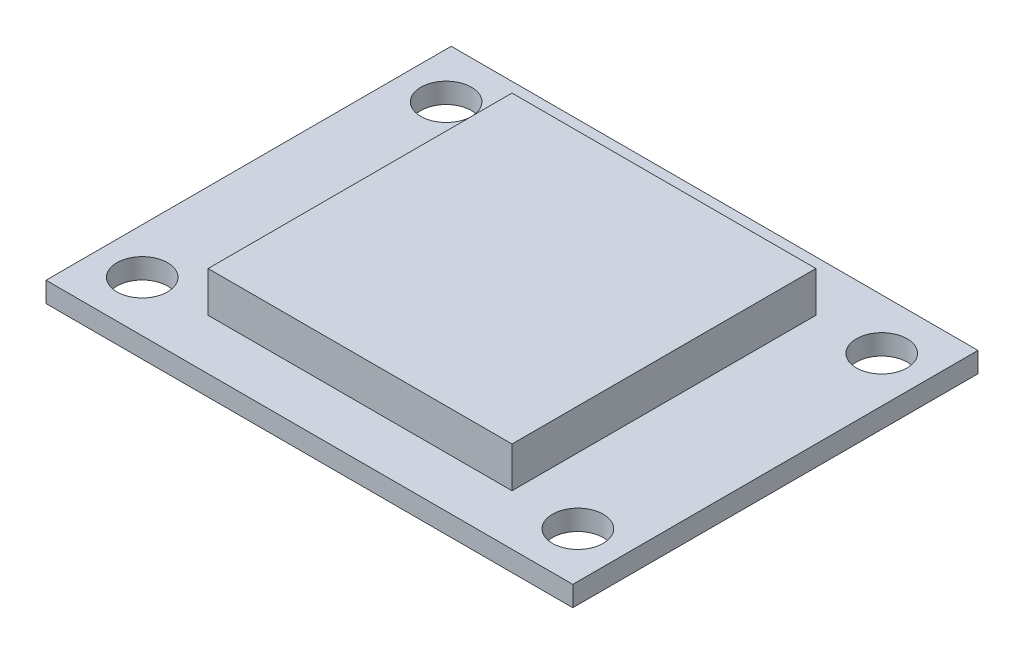
ISO-10303-21;
HEADER;
FILE_DESCRIPTION(('STEP AP214'),'2;1');
FILE_NAME('part.step','',(''),(''),'','','');
FILE_SCHEMA(('AUTOMOTIVE_DESIGN { 1 0 10303 214 1 1 1 1 }'));
ENDSEC;
DATA;
#1=APPLICATION_CONTEXT('core data for automotive mechanical design processes');
#2=APPLICATION_PROTOCOL_DEFINITION('international standard','automotive_design',2000,#1);
#3=PRODUCT_CONTEXT('',#1,'mechanical');
#4=PRODUCT('Part','Part','',(#3));
#5=PRODUCT_RELATED_PRODUCT_CATEGORY('part','',(#4));
#6=PRODUCT_DEFINITION_FORMATION('','',#4);
#7=PRODUCT_DEFINITION_CONTEXT('part definition',#1,'design');
#8=PRODUCT_DEFINITION('design','',#6,#7);
#9=PRODUCT_DEFINITION_SHAPE('','',#8);
#10=(LENGTH_UNIT() NAMED_UNIT(*) SI_UNIT(.MILLI.,.METRE.));
#11=(NAMED_UNIT(*) PLANE_ANGLE_UNIT() SI_UNIT($,.RADIAN.));
#12=(NAMED_UNIT(*) SI_UNIT($,.STERADIAN.) SOLID_ANGLE_UNIT());
#13=UNCERTAINTY_MEASURE_WITH_UNIT(LENGTH_MEASURE(1.E-05),#10,'distance_accuracy_value','');
#14=(GEOMETRIC_REPRESENTATION_CONTEXT(3) GLOBAL_UNCERTAINTY_ASSIGNED_CONTEXT((#13)) GLOBAL_UNIT_ASSIGNED_CONTEXT((#10,
#11,#12)) REPRESENTATION_CONTEXT('',''));
#15=CARTESIAN_POINT('',(0.,0.,0.));
#16=DIRECTION('',(0.,0.,1.));
#17=DIRECTION('',(1.,0.,0.));
#18=AXIS2_PLACEMENT_3D('',#15,#16,#17);
#19=CARTESIAN_POINT('',(0.,1.,0.));
#20=DIRECTION('',(0.,1.,0.));
#21=DIRECTION('',(0.,0.,1.));
#22=AXIS2_PLACEMENT_3D('',#19,#20,#21);
#23=PLANE('',#22);
#24=CARTESIAN_POINT('',(10.75,1.,-7.5));
#25=DIRECTION('',(0.,1.,0.));
#26=DIRECTION('',(0.,0.,-1.));
#27=AXIS2_PLACEMENT_3D('',#24,#25,#26);
#28=CIRCLE('',#27,1.25);
#29=CARTESIAN_POINT('',(10.75,1.,-8.75));
#30=VERTEX_POINT('',#29);
#31=EDGE_CURVE('E163',#30,#30,#28,.T.);
#32=ORIENTED_EDGE('',*,*,#31,.F.);
#33=EDGE_LOOP('',(#32));
#34=FACE_BOUND('',#33,.T.);
#35=CARTESIAN_POINT('',(10.75,1.,7.5));
#36=DIRECTION('',(0.,1.,0.));
#37=DIRECTION('',(0.,0.,1.));
#38=AXIS2_PLACEMENT_3D('',#35,#36,#37);
#39=CIRCLE('',#38,1.25);
#40=CARTESIAN_POINT('',(10.75,1.,8.75));
#41=VERTEX_POINT('',#40);
#42=EDGE_CURVE('E177',#41,#41,#39,.T.);
#43=ORIENTED_EDGE('',*,*,#42,.F.);
#44=EDGE_LOOP('',(#43));
#45=FACE_BOUND('',#44,.T.);
#46=CARTESIAN_POINT('',(-10.75,1.,7.5));
#47=DIRECTION('',(0.,1.,0.));
#48=DIRECTION('',(0.,0.,-1.));
#49=AXIS2_PLACEMENT_3D('',#46,#47,#48);
#50=CIRCLE('',#49,1.25);
#51=CARTESIAN_POINT('',(-10.75,1.,6.25));
#52=VERTEX_POINT('',#51);
#53=EDGE_CURVE('E169',#52,#52,#50,.T.);
#54=ORIENTED_EDGE('',*,*,#53,.F.);
#55=EDGE_LOOP('',(#54));
#56=FACE_BOUND('',#55,.T.);
#57=CARTESIAN_POINT('',(-10.75,1.,-7.5));
#58=DIRECTION('',(0.,1.,0.));
#59=DIRECTION('',(0.,0.,1.));
#60=AXIS2_PLACEMENT_3D('',#57,#58,#59);
#61=CIRCLE('',#60,1.25);
#62=CARTESIAN_POINT('',(-10.75,1.,-6.25));
#63=VERTEX_POINT('',#62);
#64=EDGE_CURVE('E188',#63,#63,#61,.T.);
#65=ORIENTED_EDGE('',*,*,#64,.F.);
#66=EDGE_LOOP('',(#65));
#67=FACE_BOUND('',#66,.T.);
#68=DIRECTION('',(0.,0.,-1.));
#69=VECTOR('',#68,1.);
#70=CARTESIAN_POINT('',(13.,1.,-10.));
#71=LINE('',#70,#69);
#72=CARTESIAN_POINT('',(13.,1.,10.));
#73=VERTEX_POINT('',#72);
#74=CARTESIAN_POINT('',(13.,1.,-10.));
#75=VERTEX_POINT('',#74);
#76=EDGE_CURVE('E196',#73,#75,#71,.T.);
#77=ORIENTED_EDGE('',*,*,#76,.T.);
#78=DIRECTION('',(-1.,0.,0.));
#79=VECTOR('',#78,1.);
#80=CARTESIAN_POINT('',(-13.,1.,-10.));
#81=LINE('',#80,#79);
#82=CARTESIAN_POINT('',(-13.,1.,-10.));
#83=VERTEX_POINT('',#82);
#84=EDGE_CURVE('E96',#75,#83,#81,.T.);
#85=ORIENTED_EDGE('',*,*,#84,.T.);
#86=DIRECTION('',(0.,0.,1.));
#87=VECTOR('',#86,1.);
#88=CARTESIAN_POINT('',(-13.,1.,-10.));
#89=LINE('',#88,#87);
#90=CARTESIAN_POINT('',(-13.,1.,10.));
#91=VERTEX_POINT('',#90);
#92=EDGE_CURVE('E201',#83,#91,#89,.T.);
#93=ORIENTED_EDGE('',*,*,#92,.T.);
#94=DIRECTION('',(1.,0.,0.));
#95=VECTOR('',#94,1.);
#96=CARTESIAN_POINT('',(-13.,1.,10.));
#97=LINE('',#96,#95);
#98=EDGE_CURVE('E68',#91,#73,#97,.T.);
#99=ORIENTED_EDGE('',*,*,#98,.T.);
#100=EDGE_LOOP('',(#77,#85,#93,#99));
#101=FACE_BOUND('',#100,.T.);
#102=DIRECTION('',(1.,0.,0.));
#103=VECTOR('',#102,1.);
#104=CARTESIAN_POINT('',(0.,1.,-7.5));
#105=LINE('',#104,#103);
#106=CARTESIAN_POINT('',(-7.5,1.,-7.5));
#107=VERTEX_POINT('',#106);
#108=CARTESIAN_POINT('',(7.5,1.,-7.5));
#109=VERTEX_POINT('',#108);
#110=EDGE_CURVE('E158',#107,#109,#105,.T.);
#111=ORIENTED_EDGE('',*,*,#110,.T.);
#112=DIRECTION('',(0.,0.,1.));
#113=VECTOR('',#112,1.);
#114=CARTESIAN_POINT('',(7.5,1.,0.));
#115=LINE('',#114,#113);
#116=CARTESIAN_POINT('',(7.5,1.,7.5));
#117=VERTEX_POINT('',#116);
#118=EDGE_CURVE('E143',#109,#117,#115,.T.);
#119=ORIENTED_EDGE('',*,*,#118,.T.);
#120=DIRECTION('',(-1.,0.,0.));
#121=VECTOR('',#120,1.);
#122=CARTESIAN_POINT('',(0.,1.,7.5));
#123=LINE('',#122,#121);
#124=CARTESIAN_POINT('',(-7.5,1.,7.5));
#125=VERTEX_POINT('',#124);
#126=EDGE_CURVE('E145',#117,#125,#123,.T.);
#127=ORIENTED_EDGE('',*,*,#126,.T.);
#128=DIRECTION('',(0.,0.,-1.));
#129=VECTOR('',#128,1.);
#130=CARTESIAN_POINT('',(-7.5,1.,0.));
#131=LINE('',#130,#129);
#132=EDGE_CURVE('E150',#125,#107,#131,.T.);
#133=ORIENTED_EDGE('',*,*,#132,.T.);
#134=EDGE_LOOP('',(#111,#119,#127,#133));
#135=FACE_BOUND('',#134,.T.);
#136=ADVANCED_FACE('F43',(#34,#45,#56,#67,#101,#135),#23,.T.);
#137=CARTESIAN_POINT('',(13.,1.,-10.));
#138=DIRECTION('',(-1.,0.,0.));
#139=DIRECTION('',(0.,0.,1.));
#140=AXIS2_PLACEMENT_3D('',#137,#138,#139);
#141=PLANE('',#140);
#142=DIRECTION('',(0.,0.,-1.));
#143=VECTOR('',#142,1.);
#144=CARTESIAN_POINT('',(13.,0.,-10.));
#145=LINE('',#144,#143);
#146=CARTESIAN_POINT('',(13.,0.,10.));
#147=VERTEX_POINT('',#146);
#148=CARTESIAN_POINT('',(13.,0.,-10.));
#149=VERTEX_POINT('',#148);
#150=EDGE_CURVE('E192',#147,#149,#145,.T.);
#151=ORIENTED_EDGE('',*,*,#150,.T.);
#152=DIRECTION('',(0.,-1.,0.));
#153=VECTOR('',#152,1.);
#154=CARTESIAN_POINT('',(13.,1.,-10.));
#155=LINE('',#154,#153);
#156=EDGE_CURVE('E11',#75,#149,#155,.T.);
#157=ORIENTED_EDGE('',*,*,#156,.F.);
#158=ORIENTED_EDGE('',*,*,#76,.F.);
#159=DIRECTION('',(0.,-1.,0.));
#160=VECTOR('',#159,1.);
#161=CARTESIAN_POINT('',(13.,1.,10.));
#162=LINE('',#161,#160);
#163=EDGE_CURVE('E206',#73,#147,#162,.T.);
#164=ORIENTED_EDGE('',*,*,#163,.T.);
#165=EDGE_LOOP('',(#151,#157,#158,#164));
#166=FACE_BOUND('',#165,.T.);
#167=ADVANCED_FACE('F45',(#166),#141,.F.);
#168=CARTESIAN_POINT('',(-13.,1.,-10.));
#169=DIRECTION('',(0.,0.,1.));
#170=DIRECTION('',(1.,0.,0.));
#171=AXIS2_PLACEMENT_3D('',#168,#169,#170);
#172=PLANE('',#171);
#173=DIRECTION('',(-1.,0.,0.));
#174=VECTOR('',#173,1.);
#175=CARTESIAN_POINT('',(-13.,0.,-10.));
#176=LINE('',#175,#174);
#177=CARTESIAN_POINT('',(-13.,0.,-10.));
#178=VERTEX_POINT('',#177);
#179=EDGE_CURVE('E210',#149,#178,#176,.T.);
#180=ORIENTED_EDGE('',*,*,#179,.T.);
#181=DIRECTION('',(0.,-1.,0.));
#182=VECTOR('',#181,1.);
#183=CARTESIAN_POINT('',(-13.,1.,-10.));
#184=LINE('',#183,#182);
#185=EDGE_CURVE('E52',#83,#178,#184,.T.);
#186=ORIENTED_EDGE('',*,*,#185,.F.);
#187=ORIENTED_EDGE('',*,*,#84,.F.);
#188=ORIENTED_EDGE('',*,*,#156,.T.);
#189=EDGE_LOOP('',(#180,#186,#187,#188));
#190=FACE_BOUND('',#189,.T.);
#191=ADVANCED_FACE('F245',(#190),#172,.F.);
#192=CARTESIAN_POINT('',(-13.,1.,-10.));
#193=DIRECTION('',(1.,0.,0.));
#194=DIRECTION('',(0.,0.,-1.));
#195=AXIS2_PLACEMENT_3D('',#192,#193,#194);
#196=PLANE('',#195);
#197=DIRECTION('',(0.,0.,1.));
#198=VECTOR('',#197,1.);
#199=CARTESIAN_POINT('',(-13.,0.,-10.));
#200=LINE('',#199,#198);
#201=CARTESIAN_POINT('',(-13.,0.,10.));
#202=VERTEX_POINT('',#201);
#203=EDGE_CURVE('E213',#178,#202,#200,.T.);
#204=ORIENTED_EDGE('',*,*,#203,.T.);
#205=DIRECTION('',(0.,-1.,0.));
#206=VECTOR('',#205,1.);
#207=CARTESIAN_POINT('',(-13.,1.,10.));
#208=LINE('',#207,#206);
#209=EDGE_CURVE('E220',#91,#202,#208,.T.);
#210=ORIENTED_EDGE('',*,*,#209,.F.);
#211=ORIENTED_EDGE('',*,*,#92,.F.);
#212=ORIENTED_EDGE('',*,*,#185,.T.);
#213=EDGE_LOOP('',(#204,#210,#211,#212));
#214=FACE_BOUND('',#213,.T.);
#215=ADVANCED_FACE('F227',(#214),#196,.F.);
#216=CARTESIAN_POINT('',(-13.,1.,10.));
#217=DIRECTION('',(0.,0.,-1.));
#218=DIRECTION('',(-1.,0.,0.));
#219=AXIS2_PLACEMENT_3D('',#216,#217,#218);
#220=PLANE('',#219);
#221=DIRECTION('',(1.,0.,0.));
#222=VECTOR('',#221,1.);
#223=CARTESIAN_POINT('',(-13.,0.,10.));
#224=LINE('',#223,#222);
#225=EDGE_CURVE('E89',#202,#147,#224,.T.);
#226=ORIENTED_EDGE('',*,*,#225,.T.);
#227=ORIENTED_EDGE('',*,*,#163,.F.);
#228=ORIENTED_EDGE('',*,*,#98,.F.);
#229=ORIENTED_EDGE('',*,*,#209,.T.);
#230=EDGE_LOOP('',(#226,#227,#228,#229));
#231=FACE_BOUND('',#230,.T.);
#232=ADVANCED_FACE('F236',(#231),#220,.F.);
#233=CARTESIAN_POINT('',(0.,0.,0.));
#234=DIRECTION('',(0.,1.,0.));
#235=DIRECTION('',(0.,0.,1.));
#236=AXIS2_PLACEMENT_3D('',#233,#234,#235);
#237=PLANE('',#236);
#238=ORIENTED_EDGE('',*,*,#150,.F.);
#239=ORIENTED_EDGE('',*,*,#225,.F.);
#240=ORIENTED_EDGE('',*,*,#203,.F.);
#241=ORIENTED_EDGE('',*,*,#179,.F.);
#242=EDGE_LOOP('',(#238,#239,#240,#241));
#243=FACE_BOUND('',#242,.T.);
#244=CARTESIAN_POINT('',(-10.75,0.,-7.5));
#245=DIRECTION('',(0.,1.,0.));
#246=DIRECTION('',(0.,0.,1.));
#247=AXIS2_PLACEMENT_3D('',#244,#245,#246);
#248=CIRCLE('',#247,1.25);
#249=CARTESIAN_POINT('',(-10.75,0.,-6.25));
#250=VERTEX_POINT('',#249);
#251=EDGE_CURVE('E168',#250,#250,#248,.T.);
#252=ORIENTED_EDGE('',*,*,#251,.T.);
#253=EDGE_LOOP('',(#252));
#254=FACE_BOUND('',#253,.T.);
#255=CARTESIAN_POINT('',(-10.75,0.,7.5));
#256=DIRECTION('',(0.,1.,0.));
#257=DIRECTION('',(0.,0.,-1.));
#258=AXIS2_PLACEMENT_3D('',#255,#256,#257);
#259=CIRCLE('',#258,1.25);
#260=CARTESIAN_POINT('',(-10.75,0.,6.25));
#261=VERTEX_POINT('',#260);
#262=EDGE_CURVE('E164',#261,#261,#259,.T.);
#263=ORIENTED_EDGE('',*,*,#262,.T.);
#264=EDGE_LOOP('',(#263));
#265=FACE_BOUND('',#264,.T.);
#266=CARTESIAN_POINT('',(10.75,0.,7.5));
#267=DIRECTION('',(0.,1.,0.));
#268=DIRECTION('',(0.,0.,1.));
#269=AXIS2_PLACEMENT_3D('',#266,#267,#268);
#270=CIRCLE('',#269,1.25);
#271=CARTESIAN_POINT('',(10.75,0.,8.75));
#272=VERTEX_POINT('',#271);
#273=EDGE_CURVE('E173',#272,#272,#270,.T.);
#274=ORIENTED_EDGE('',*,*,#273,.T.);
#275=EDGE_LOOP('',(#274));
#276=FACE_BOUND('',#275,.T.);
#277=CARTESIAN_POINT('',(10.75,0.,-7.5));
#278=DIRECTION('',(0.,1.,0.));
#279=DIRECTION('',(0.,0.,-1.));
#280=AXIS2_PLACEMENT_3D('',#277,#278,#279);
#281=CIRCLE('',#280,1.25);
#282=CARTESIAN_POINT('',(10.75,0.,-8.75));
#283=VERTEX_POINT('',#282);
#284=EDGE_CURVE('E181',#283,#283,#281,.T.);
#285=ORIENTED_EDGE('',*,*,#284,.T.);
#286=EDGE_LOOP('',(#285));
#287=FACE_BOUND('',#286,.T.);
#288=ADVANCED_FACE('F231',(#243,#254,#265,#276,#287),#237,.F.);
#289=CARTESIAN_POINT('',(-10.75,1.,-7.5));
#290=DIRECTION('',(0.,-1.,0.));
#291=DIRECTION('',(0.,0.,-1.));
#292=AXIS2_PLACEMENT_3D('',#289,#290,#291);
#293=CYLINDRICAL_SURFACE('',#292,1.25);
#294=ORIENTED_EDGE('',*,*,#64,.T.);
#295=EDGE_LOOP('',(#294));
#296=FACE_BOUND('',#295,.T.);
#297=ORIENTED_EDGE('',*,*,#251,.F.);
#298=EDGE_LOOP('',(#297));
#299=FACE_BOUND('',#298,.T.);
#300=ADVANCED_FACE('F243',(#296,#299),#293,.F.);
#301=CARTESIAN_POINT('',(-10.75,1.,7.5));
#302=DIRECTION('',(0.,-1.,0.));
#303=DIRECTION('',(0.,0.,-1.));
#304=AXIS2_PLACEMENT_3D('',#301,#302,#303);
#305=CYLINDRICAL_SURFACE('',#304,1.25);
#306=ORIENTED_EDGE('',*,*,#53,.T.);
#307=EDGE_LOOP('',(#306));
#308=FACE_BOUND('',#307,.T.);
#309=ORIENTED_EDGE('',*,*,#262,.F.);
#310=EDGE_LOOP('',(#309));
#311=FACE_BOUND('',#310,.T.);
#312=ADVANCED_FACE('F258',(#308,#311),#305,.F.);
#313=CARTESIAN_POINT('',(10.75,1.,7.5));
#314=DIRECTION('',(0.,-1.,0.));
#315=DIRECTION('',(0.,0.,-1.));
#316=AXIS2_PLACEMENT_3D('',#313,#314,#315);
#317=CYLINDRICAL_SURFACE('',#316,1.25);
#318=ORIENTED_EDGE('',*,*,#42,.T.);
#319=EDGE_LOOP('',(#318));
#320=FACE_BOUND('',#319,.T.);
#321=ORIENTED_EDGE('',*,*,#273,.F.);
#322=EDGE_LOOP('',(#321));
#323=FACE_BOUND('',#322,.T.);
#324=ADVANCED_FACE('F263',(#320,#323),#317,.F.);
#325=CARTESIAN_POINT('',(10.75,1.,-7.5));
#326=DIRECTION('',(0.,-1.,0.));
#327=DIRECTION('',(0.,0.,-1.));
#328=AXIS2_PLACEMENT_3D('',#325,#326,#327);
#329=CYLINDRICAL_SURFACE('',#328,1.25);
#330=ORIENTED_EDGE('',*,*,#31,.T.);
#331=EDGE_LOOP('',(#330));
#332=FACE_BOUND('',#331,.T.);
#333=ORIENTED_EDGE('',*,*,#284,.F.);
#334=EDGE_LOOP('',(#333));
#335=FACE_BOUND('',#334,.T.);
#336=ADVANCED_FACE('F260',(#332,#335),#329,.F.);
#337=CARTESIAN_POINT('',(7.5,3.,-7.5));
#338=DIRECTION('',(-1.,0.,0.));
#339=DIRECTION('',(0.,0.,1.));
#340=AXIS2_PLACEMENT_3D('',#337,#338,#339);
#341=PLANE('',#340);
#342=ORIENTED_EDGE('',*,*,#118,.F.);
#343=DIRECTION('',(0.,-1.,0.));
#344=VECTOR('',#343,1.);
#345=CARTESIAN_POINT('',(7.5,3.,-7.5));
#346=LINE('',#345,#344);
#347=CARTESIAN_POINT('',(7.5,3.,-7.5));
#348=VERTEX_POINT('',#347);
#349=EDGE_CURVE('E123',#348,#109,#346,.T.);
#350=ORIENTED_EDGE('',*,*,#349,.F.);
#351=DIRECTION('',(0.,0.,-1.));
#352=VECTOR('',#351,1.);
#353=CARTESIAN_POINT('',(7.5,3.,-7.5));
#354=LINE('',#353,#352);
#355=CARTESIAN_POINT('',(7.5,3.,7.5));
#356=VERTEX_POINT('',#355);
#357=EDGE_CURVE('E131',#356,#348,#354,.T.);
#358=ORIENTED_EDGE('',*,*,#357,.F.);
#359=DIRECTION('',(0.,-1.,0.));
#360=VECTOR('',#359,1.);
#361=CARTESIAN_POINT('',(7.5,3.,7.5));
#362=LINE('',#361,#360);
#363=EDGE_CURVE('E400',#356,#117,#362,.T.);
#364=ORIENTED_EDGE('',*,*,#363,.T.);
#365=EDGE_LOOP('',(#342,#350,#358,#364));
#366=FACE_BOUND('',#365,.T.);
#367=ADVANCED_FACE('F141',(#366),#341,.F.);
#368=CARTESIAN_POINT('',(-7.5,3.,-7.5));
#369=DIRECTION('',(0.,0.,1.));
#370=DIRECTION('',(1.,0.,0.));
#371=AXIS2_PLACEMENT_3D('',#368,#369,#370);
#372=PLANE('',#371);
#373=ORIENTED_EDGE('',*,*,#110,.F.);
#374=DIRECTION('',(0.,-1.,0.));
#375=VECTOR('',#374,1.);
#376=CARTESIAN_POINT('',(-7.5,3.,-7.5));
#377=LINE('',#376,#375);
#378=CARTESIAN_POINT('',(-7.5,3.,-7.5));
#379=VERTEX_POINT('',#378);
#380=EDGE_CURVE('E126',#379,#107,#377,.T.);
#381=ORIENTED_EDGE('',*,*,#380,.F.);
#382=DIRECTION('',(-1.,0.,0.));
#383=VECTOR('',#382,1.);
#384=CARTESIAN_POINT('',(-7.5,3.,-7.5));
#385=LINE('',#384,#383);
#386=EDGE_CURVE('E119',#348,#379,#385,.T.);
#387=ORIENTED_EDGE('',*,*,#386,.F.);
#388=ORIENTED_EDGE('',*,*,#349,.T.);
#389=EDGE_LOOP('',(#373,#381,#387,#388));
#390=FACE_BOUND('',#389,.T.);
#391=ADVANCED_FACE('F121',(#390),#372,.F.);
#392=CARTESIAN_POINT('',(-7.5,3.,-7.5));
#393=DIRECTION('',(1.,0.,0.));
#394=DIRECTION('',(0.,0.,-1.));
#395=AXIS2_PLACEMENT_3D('',#392,#393,#394);
#396=PLANE('',#395);
#397=ORIENTED_EDGE('',*,*,#132,.F.);
#398=DIRECTION('',(0.,-1.,0.));
#399=VECTOR('',#398,1.);
#400=CARTESIAN_POINT('',(-7.5,3.,7.5));
#401=LINE('',#400,#399);
#402=CARTESIAN_POINT('',(-7.5,3.,7.5));
#403=VERTEX_POINT('',#402);
#404=EDGE_CURVE('E59',#403,#125,#401,.T.);
#405=ORIENTED_EDGE('',*,*,#404,.F.);
#406=DIRECTION('',(0.,0.,1.));
#407=VECTOR('',#406,1.);
#408=CARTESIAN_POINT('',(-7.5,3.,-7.5));
#409=LINE('',#408,#407);
#410=EDGE_CURVE('E130',#379,#403,#409,.T.);
#411=ORIENTED_EDGE('',*,*,#410,.F.);
#412=ORIENTED_EDGE('',*,*,#380,.T.);
#413=EDGE_LOOP('',(#397,#405,#411,#412));
#414=FACE_BOUND('',#413,.T.);
#415=ADVANCED_FACE('F275',(#414),#396,.F.);
#416=CARTESIAN_POINT('',(-7.5,3.,7.5));
#417=DIRECTION('',(0.,0.,-1.));
#418=DIRECTION('',(-1.,0.,0.));
#419=AXIS2_PLACEMENT_3D('',#416,#417,#418);
#420=PLANE('',#419);
#421=ORIENTED_EDGE('',*,*,#126,.F.);
#422=ORIENTED_EDGE('',*,*,#363,.F.);
#423=DIRECTION('',(1.,0.,0.));
#424=VECTOR('',#423,1.);
#425=CARTESIAN_POINT('',(-7.5,3.,7.5));
#426=LINE('',#425,#424);
#427=EDGE_CURVE('E135',#403,#356,#426,.T.);
#428=ORIENTED_EDGE('',*,*,#427,.F.);
#429=ORIENTED_EDGE('',*,*,#404,.T.);
#430=EDGE_LOOP('',(#421,#422,#428,#429));
#431=FACE_BOUND('',#430,.T.);
#432=ADVANCED_FACE('F278',(#431),#420,.F.);
#433=CARTESIAN_POINT('',(0.,3.,0.));
#434=DIRECTION('',(0.,1.,0.));
#435=DIRECTION('',(0.,0.,1.));
#436=AXIS2_PLACEMENT_3D('',#433,#434,#435);
#437=PLANE('',#436);
#438=ORIENTED_EDGE('',*,*,#357,.T.);
#439=ORIENTED_EDGE('',*,*,#386,.T.);
#440=ORIENTED_EDGE('',*,*,#410,.T.);
#441=ORIENTED_EDGE('',*,*,#427,.T.);
#442=EDGE_LOOP('',(#438,#439,#440,#441));
#443=FACE_BOUND('',#442,.T.);
#444=ADVANCED_FACE('F134',(#443),#437,.T.);
#445=CLOSED_SHELL('',(#136,#167,#191,#215,#232,#288,#300,#312,#324,#336,#367,#391,#415,#432,#444));
#446=MANIFOLD_SOLID_BREP('B2',#445);
#447=ADVANCED_BREP_SHAPE_REPRESENTATION('',(#18,#446),#14);
#448=SHAPE_DEFINITION_REPRESENTATION(#9,#447);
ENDSEC;
END-ISO-10303-21;
